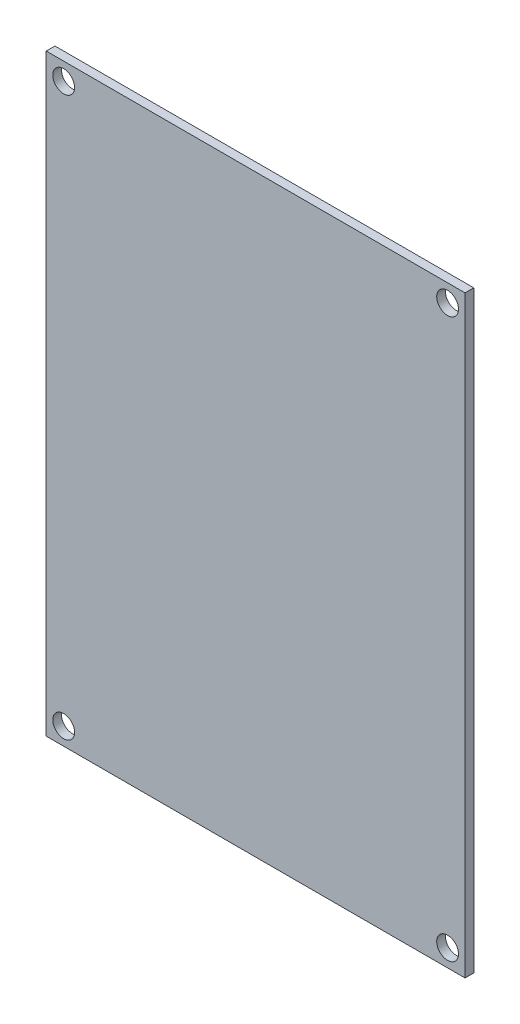
ISO-10303-21;
HEADER;
FILE_DESCRIPTION(('STEP AP214'),'2;1');
FILE_NAME('part.step','',(''),(''),'','','');
FILE_SCHEMA(('AUTOMOTIVE_DESIGN { 1 0 10303 214 1 1 1 1 }'));
ENDSEC;
DATA;
#1=APPLICATION_CONTEXT('core data for automotive mechanical design processes');
#2=APPLICATION_PROTOCOL_DEFINITION('international standard','automotive_design',2000,#1);
#3=PRODUCT_CONTEXT('',#1,'mechanical');
#4=PRODUCT('Part','Part','',(#3));
#5=PRODUCT_RELATED_PRODUCT_CATEGORY('part','',(#4));
#6=PRODUCT_DEFINITION_FORMATION('','',#4);
#7=PRODUCT_DEFINITION_CONTEXT('part definition',#1,'design');
#8=PRODUCT_DEFINITION('design','',#6,#7);
#9=PRODUCT_DEFINITION_SHAPE('','',#8);
#10=(LENGTH_UNIT() NAMED_UNIT(*) SI_UNIT(.MILLI.,.METRE.));
#11=(NAMED_UNIT(*) PLANE_ANGLE_UNIT() SI_UNIT($,.RADIAN.));
#12=(NAMED_UNIT(*) SI_UNIT($,.STERADIAN.) SOLID_ANGLE_UNIT());
#13=UNCERTAINTY_MEASURE_WITH_UNIT(LENGTH_MEASURE(1.E-05),#10,'distance_accuracy_value','');
#14=(GEOMETRIC_REPRESENTATION_CONTEXT(3) GLOBAL_UNCERTAINTY_ASSIGNED_CONTEXT((#13)) GLOBAL_UNIT_ASSIGNED_CONTEXT((#10,
#11,#12)) REPRESENTATION_CONTEXT('',''));
#15=CARTESIAN_POINT('',(0.,0.,0.));
#16=DIRECTION('',(0.,0.,1.));
#17=DIRECTION('',(1.,0.,0.));
#18=AXIS2_PLACEMENT_3D('',#15,#16,#17);
#19=CARTESIAN_POINT('',(-290.,340.,10.));
#20=DIRECTION('',(1.,0.,0.));
#21=DIRECTION('',(0.,1.,0.));
#22=AXIS2_PLACEMENT_3D('',#19,#20,#21);
#23=PLANE('',#22);
#24=DIRECTION('',(0.,-1.,0.));
#25=VECTOR('',#24,1.);
#26=CARTESIAN_POINT('',(-290.,340.,0.));
#27=LINE('',#26,#25);
#28=CARTESIAN_POINT('',(-290.,340.,0.));
#29=VERTEX_POINT('',#28);
#30=CARTESIAN_POINT('',(-290.,-340.,0.));
#31=VERTEX_POINT('',#30);
#32=EDGE_CURVE('E96',#29,#31,#27,.T.);
#33=ORIENTED_EDGE('',*,*,#32,.T.);
#34=DIRECTION('',(0.,0.,-1.));
#35=VECTOR('',#34,1.);
#36=CARTESIAN_POINT('',(-290.,-340.,10.));
#37=LINE('',#36,#35);
#38=CARTESIAN_POINT('',(-290.,-340.,10.));
#39=VERTEX_POINT('',#38);
#40=EDGE_CURVE('E11',#39,#31,#37,.T.);
#41=ORIENTED_EDGE('',*,*,#40,.F.);
#42=DIRECTION('',(0.,-1.,0.));
#43=VECTOR('',#42,1.);
#44=CARTESIAN_POINT('',(-290.,340.,10.));
#45=LINE('',#44,#43);
#46=CARTESIAN_POINT('',(-290.,340.,10.));
#47=VERTEX_POINT('',#46);
#48=EDGE_CURVE('E84',#47,#39,#45,.T.);
#49=ORIENTED_EDGE('',*,*,#48,.F.);
#50=DIRECTION('',(0.,0.,-1.));
#51=VECTOR('',#50,1.);
#52=CARTESIAN_POINT('',(-290.,340.,10.));
#53=LINE('',#52,#51);
#54=EDGE_CURVE('E92',#47,#29,#53,.T.);
#55=ORIENTED_EDGE('',*,*,#54,.T.);
#56=EDGE_LOOP('',(#33,#41,#49,#55));
#57=FACE_BOUND('',#56,.T.);
#58=ADVANCED_FACE('F33',(#57),#23,.F.);
#59=CARTESIAN_POINT('',(-290.,-340.,10.));
#60=DIRECTION('',(0.,1.,0.));
#61=DIRECTION('',(0.,0.,1.));
#62=AXIS2_PLACEMENT_3D('',#59,#60,#61);
#63=PLANE('',#62);
#64=DIRECTION('',(1.,0.,0.));
#65=VECTOR('',#64,1.);
#66=CARTESIAN_POINT('',(-290.,-340.,0.));
#67=LINE('',#66,#65);
#68=CARTESIAN_POINT('',(190.,-340.,0.));
#69=VERTEX_POINT('',#68);
#70=EDGE_CURVE('E88',#31,#69,#67,.T.);
#71=ORIENTED_EDGE('',*,*,#70,.T.);
#72=DIRECTION('',(0.,0.,-1.));
#73=VECTOR('',#72,1.);
#74=CARTESIAN_POINT('',(190.,-340.,10.));
#75=LINE('',#74,#73);
#76=CARTESIAN_POINT('',(190.,-340.,10.));
#77=VERTEX_POINT('',#76);
#78=EDGE_CURVE('E41',#77,#69,#75,.T.);
#79=ORIENTED_EDGE('',*,*,#78,.F.);
#80=DIRECTION('',(1.,0.,0.));
#81=VECTOR('',#80,1.);
#82=CARTESIAN_POINT('',(-290.,-340.,10.));
#83=LINE('',#82,#81);
#84=EDGE_CURVE('E79',#39,#77,#83,.T.);
#85=ORIENTED_EDGE('',*,*,#84,.F.);
#86=ORIENTED_EDGE('',*,*,#40,.T.);
#87=EDGE_LOOP('',(#71,#79,#85,#86));
#88=FACE_BOUND('',#87,.T.);
#89=ADVANCED_FACE('F87',(#88),#63,.F.);
#90=CARTESIAN_POINT('',(190.,340.,10.));
#91=DIRECTION('',(-1.,0.,0.));
#92=DIRECTION('',(0.,-1.,0.));
#93=AXIS2_PLACEMENT_3D('',#90,#91,#92);
#94=PLANE('',#93);
#95=DIRECTION('',(0.,1.,0.));
#96=VECTOR('',#95,1.);
#97=CARTESIAN_POINT('',(190.,340.,0.));
#98=LINE('',#97,#96);
#99=CARTESIAN_POINT('',(190.,340.,0.));
#100=VERTEX_POINT('',#99);
#101=EDGE_CURVE('E66',#69,#100,#98,.T.);
#102=ORIENTED_EDGE('',*,*,#101,.T.);
#103=DIRECTION('',(0.,0.,-1.));
#104=VECTOR('',#103,1.);
#105=CARTESIAN_POINT('',(190.,340.,10.));
#106=LINE('',#105,#104);
#107=CARTESIAN_POINT('',(190.,340.,10.));
#108=VERTEX_POINT('',#107);
#109=EDGE_CURVE('E89',#108,#100,#106,.T.);
#110=ORIENTED_EDGE('',*,*,#109,.F.);
#111=DIRECTION('',(0.,1.,0.));
#112=VECTOR('',#111,1.);
#113=CARTESIAN_POINT('',(190.,340.,10.));
#114=LINE('',#113,#112);
#115=EDGE_CURVE('E82',#77,#108,#114,.T.);
#116=ORIENTED_EDGE('',*,*,#115,.F.);
#117=ORIENTED_EDGE('',*,*,#78,.T.);
#118=EDGE_LOOP('',(#102,#110,#116,#117));
#119=FACE_BOUND('',#118,.T.);
#120=ADVANCED_FACE('F90',(#119),#94,.F.);
#121=CARTESIAN_POINT('',(-290.,340.,10.));
#122=DIRECTION('',(0.,-1.,0.));
#123=DIRECTION('',(0.,0.,-1.));
#124=AXIS2_PLACEMENT_3D('',#121,#122,#123);
#125=PLANE('',#124);
#126=DIRECTION('',(-1.,0.,0.));
#127=VECTOR('',#126,1.);
#128=CARTESIAN_POINT('',(-290.,340.,0.));
#129=LINE('',#128,#127);
#130=EDGE_CURVE('E72',#100,#29,#129,.T.);
#131=ORIENTED_EDGE('',*,*,#130,.T.);
#132=ORIENTED_EDGE('',*,*,#54,.F.);
#133=DIRECTION('',(-1.,0.,0.));
#134=VECTOR('',#133,1.);
#135=CARTESIAN_POINT('',(-290.,340.,10.));
#136=LINE('',#135,#134);
#137=EDGE_CURVE('E49',#108,#47,#136,.T.);
#138=ORIENTED_EDGE('',*,*,#137,.F.);
#139=ORIENTED_EDGE('',*,*,#109,.T.);
#140=EDGE_LOOP('',(#131,#132,#138,#139));
#141=FACE_BOUND('',#140,.T.);
#142=ADVANCED_FACE('F104',(#141),#125,.F.);
#143=CARTESIAN_POINT('',(0.,0.,10.));
#144=DIRECTION('',(0.,0.,1.));
#145=DIRECTION('',(1.,0.,0.));
#146=AXIS2_PLACEMENT_3D('',#143,#144,#145);
#147=PLANE('',#146);
#148=CARTESIAN_POINT('',(170.,-320.,10.));
#149=DIRECTION('',(0.,0.,1.));
#150=DIRECTION('',(1.,0.,0.));
#151=AXIS2_PLACEMENT_3D('',#148,#149,#150);
#152=CIRCLE('',#151,12.5);
#153=CARTESIAN_POINT('',(182.5,-320.,10.));
#154=VERTEX_POINT('',#153);
#155=EDGE_CURVE('E128',#154,#154,#152,.T.);
#156=ORIENTED_EDGE('',*,*,#155,.F.);
#157=EDGE_LOOP('',(#156));
#158=FACE_BOUND('',#157,.T.);
#159=CARTESIAN_POINT('',(-270.,-320.,10.));
#160=DIRECTION('',(0.,0.,1.));
#161=DIRECTION('',(1.,0.,0.));
#162=AXIS2_PLACEMENT_3D('',#159,#160,#161);
#163=CIRCLE('',#162,12.5);
#164=CARTESIAN_POINT('',(-257.5,-320.,10.));
#165=VERTEX_POINT('',#164);
#166=EDGE_CURVE('E122',#165,#165,#163,.T.);
#167=ORIENTED_EDGE('',*,*,#166,.F.);
#168=EDGE_LOOP('',(#167));
#169=FACE_BOUND('',#168,.T.);
#170=CARTESIAN_POINT('',(-270.,320.,10.));
#171=DIRECTION('',(0.,0.,1.));
#172=DIRECTION('',(1.,0.,0.));
#173=AXIS2_PLACEMENT_3D('',#170,#171,#172);
#174=CIRCLE('',#173,12.5);
#175=CARTESIAN_POINT('',(-257.5,320.,10.));
#176=VERTEX_POINT('',#175);
#177=EDGE_CURVE('E116',#176,#176,#174,.T.);
#178=ORIENTED_EDGE('',*,*,#177,.F.);
#179=EDGE_LOOP('',(#178));
#180=FACE_BOUND('',#179,.T.);
#181=CARTESIAN_POINT('',(170.,320.,10.));
#182=DIRECTION('',(0.,0.,1.));
#183=DIRECTION('',(1.,0.,0.));
#184=AXIS2_PLACEMENT_3D('',#181,#182,#183);
#185=CIRCLE('',#184,12.5);
#186=CARTESIAN_POINT('',(182.5,320.,10.));
#187=VERTEX_POINT('',#186);
#188=EDGE_CURVE('E110',#187,#187,#185,.T.);
#189=ORIENTED_EDGE('',*,*,#188,.F.);
#190=EDGE_LOOP('',(#189));
#191=FACE_BOUND('',#190,.T.);
#192=ORIENTED_EDGE('',*,*,#48,.T.);
#193=ORIENTED_EDGE('',*,*,#84,.T.);
#194=ORIENTED_EDGE('',*,*,#115,.T.);
#195=ORIENTED_EDGE('',*,*,#137,.T.);
#196=EDGE_LOOP('',(#192,#193,#194,#195));
#197=FACE_BOUND('',#196,.T.);
#198=ADVANCED_FACE('F80',(#158,#169,#180,#191,#197),#147,.T.);
#199=CARTESIAN_POINT('',(0.,0.,0.));
#200=DIRECTION('',(0.,0.,1.));
#201=DIRECTION('',(1.,0.,0.));
#202=AXIS2_PLACEMENT_3D('',#199,#200,#201);
#203=PLANE('',#202);
#204=CARTESIAN_POINT('',(170.,-320.,0.));
#205=DIRECTION('',(0.,0.,1.));
#206=DIRECTION('',(1.,0.,0.));
#207=AXIS2_PLACEMENT_3D('',#204,#205,#206);
#208=CIRCLE('',#207,12.5);
#209=CARTESIAN_POINT('',(182.5,-320.,0.));
#210=VERTEX_POINT('',#209);
#211=EDGE_CURVE('E125',#210,#210,#208,.T.);
#212=ORIENTED_EDGE('',*,*,#211,.T.);
#213=EDGE_LOOP('',(#212));
#214=FACE_BOUND('',#213,.T.);
#215=CARTESIAN_POINT('',(-270.,-320.,0.));
#216=DIRECTION('',(0.,0.,1.));
#217=DIRECTION('',(1.,0.,0.));
#218=AXIS2_PLACEMENT_3D('',#215,#216,#217);
#219=CIRCLE('',#218,12.5);
#220=CARTESIAN_POINT('',(-257.5,-320.,0.));
#221=VERTEX_POINT('',#220);
#222=EDGE_CURVE('E119',#221,#221,#219,.T.);
#223=ORIENTED_EDGE('',*,*,#222,.T.);
#224=EDGE_LOOP('',(#223));
#225=FACE_BOUND('',#224,.T.);
#226=CARTESIAN_POINT('',(-270.,320.,0.));
#227=DIRECTION('',(0.,0.,1.));
#228=DIRECTION('',(1.,0.,0.));
#229=AXIS2_PLACEMENT_3D('',#226,#227,#228);
#230=CIRCLE('',#229,12.5);
#231=CARTESIAN_POINT('',(-257.5,320.,0.));
#232=VERTEX_POINT('',#231);
#233=EDGE_CURVE('E113',#232,#232,#230,.T.);
#234=ORIENTED_EDGE('',*,*,#233,.T.);
#235=EDGE_LOOP('',(#234));
#236=FACE_BOUND('',#235,.T.);
#237=CARTESIAN_POINT('',(170.,320.,0.));
#238=DIRECTION('',(0.,0.,1.));
#239=DIRECTION('',(1.,0.,0.));
#240=AXIS2_PLACEMENT_3D('',#237,#238,#239);
#241=CIRCLE('',#240,12.5);
#242=CARTESIAN_POINT('',(182.5,320.,0.));
#243=VERTEX_POINT('',#242);
#244=EDGE_CURVE('E99',#243,#243,#241,.T.);
#245=ORIENTED_EDGE('',*,*,#244,.T.);
#246=EDGE_LOOP('',(#245));
#247=FACE_BOUND('',#246,.T.);
#248=ORIENTED_EDGE('',*,*,#32,.F.);
#249=ORIENTED_EDGE('',*,*,#130,.F.);
#250=ORIENTED_EDGE('',*,*,#101,.F.);
#251=ORIENTED_EDGE('',*,*,#70,.F.);
#252=EDGE_LOOP('',(#248,#249,#250,#251));
#253=FACE_BOUND('',#252,.T.);
#254=ADVANCED_FACE('F107',(#214,#225,#236,#247,#253),#203,.F.);
#255=CARTESIAN_POINT('',(170.,320.,0.));
#256=DIRECTION('',(0.,0.,1.));
#257=DIRECTION('',(1.,0.,0.));
#258=AXIS2_PLACEMENT_3D('',#255,#256,#257);
#259=CYLINDRICAL_SURFACE('',#258,12.5);
#260=ORIENTED_EDGE('',*,*,#244,.F.);
#261=EDGE_LOOP('',(#260));
#262=FACE_BOUND('',#261,.T.);
#263=ORIENTED_EDGE('',*,*,#188,.T.);
#264=EDGE_LOOP('',(#263));
#265=FACE_BOUND('',#264,.T.);
#266=ADVANCED_FACE('F152',(#262,#265),#259,.F.);
#267=CARTESIAN_POINT('',(-270.,320.,0.));
#268=DIRECTION('',(0.,0.,1.));
#269=DIRECTION('',(1.,0.,0.));
#270=AXIS2_PLACEMENT_3D('',#267,#268,#269);
#271=CYLINDRICAL_SURFACE('',#270,12.5);
#272=ORIENTED_EDGE('',*,*,#233,.F.);
#273=EDGE_LOOP('',(#272));
#274=FACE_BOUND('',#273,.T.);
#275=ORIENTED_EDGE('',*,*,#177,.T.);
#276=EDGE_LOOP('',(#275));
#277=FACE_BOUND('',#276,.T.);
#278=ADVANCED_FACE('F154',(#274,#277),#271,.F.);
#279=CARTESIAN_POINT('',(-270.,-320.,0.));
#280=DIRECTION('',(0.,0.,1.));
#281=DIRECTION('',(1.,0.,0.));
#282=AXIS2_PLACEMENT_3D('',#279,#280,#281);
#283=CYLINDRICAL_SURFACE('',#282,12.5);
#284=ORIENTED_EDGE('',*,*,#222,.F.);
#285=EDGE_LOOP('',(#284));
#286=FACE_BOUND('',#285,.T.);
#287=ORIENTED_EDGE('',*,*,#166,.T.);
#288=EDGE_LOOP('',(#287));
#289=FACE_BOUND('',#288,.T.);
#290=ADVANCED_FACE('F139',(#286,#289),#283,.F.);
#291=CARTESIAN_POINT('',(170.,-320.,0.));
#292=DIRECTION('',(0.,0.,1.));
#293=DIRECTION('',(1.,0.,0.));
#294=AXIS2_PLACEMENT_3D('',#291,#292,#293);
#295=CYLINDRICAL_SURFACE('',#294,12.5);
#296=ORIENTED_EDGE('',*,*,#211,.F.);
#297=EDGE_LOOP('',(#296));
#298=FACE_BOUND('',#297,.T.);
#299=ORIENTED_EDGE('',*,*,#155,.T.);
#300=EDGE_LOOP('',(#299));
#301=FACE_BOUND('',#300,.T.);
#302=ADVANCED_FACE('F136',(#298,#301),#295,.F.);
#303=CLOSED_SHELL('',(#58,#89,#120,#142,#198,#254,#266,#278,#290,#302));
#304=MANIFOLD_SOLID_BREP('B2',#303);
#305=ADVANCED_BREP_SHAPE_REPRESENTATION('',(#18,#304),#14);
#306=SHAPE_DEFINITION_REPRESENTATION(#9,#305);
ENDSEC;
END-ISO-10303-21;
